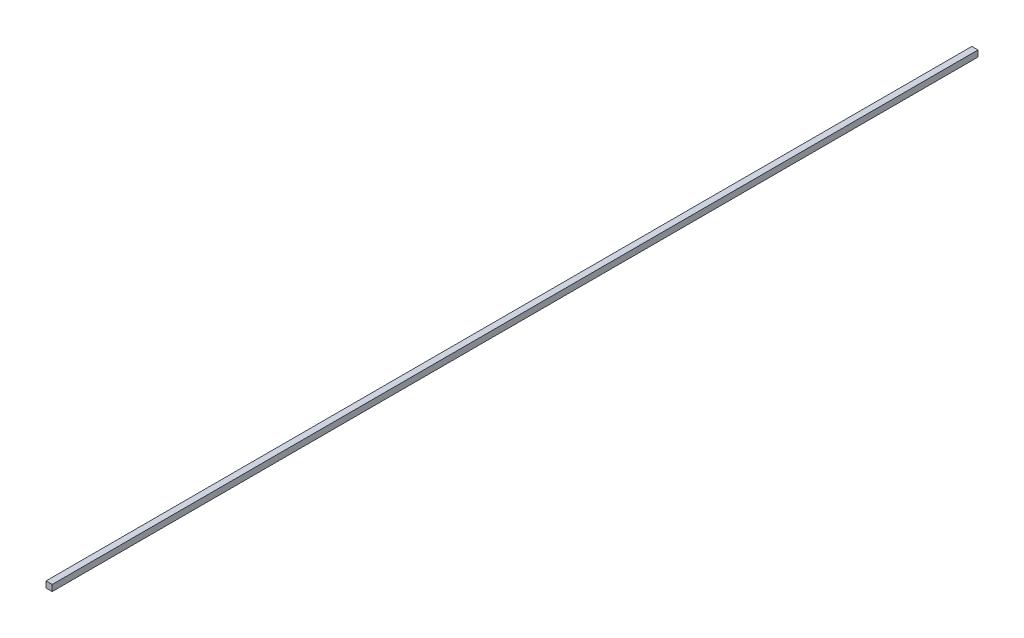
ISO-10303-21;
HEADER;
FILE_DESCRIPTION(('STEP AP214'),'2;1');
FILE_NAME('part.step','',(''),(''),'','','');
FILE_SCHEMA(('AUTOMOTIVE_DESIGN { 1 0 10303 214 1 1 1 1 }'));
ENDSEC;
DATA;
#1=APPLICATION_CONTEXT('core data for automotive mechanical design processes');
#2=APPLICATION_PROTOCOL_DEFINITION('international standard','automotive_design',2000,#1);
#3=PRODUCT_CONTEXT('',#1,'mechanical');
#4=PRODUCT('Part','Part','',(#3));
#5=PRODUCT_RELATED_PRODUCT_CATEGORY('part','',(#4));
#6=PRODUCT_DEFINITION_FORMATION('','',#4);
#7=PRODUCT_DEFINITION_CONTEXT('part definition',#1,'design');
#8=PRODUCT_DEFINITION('design','',#6,#7);
#9=PRODUCT_DEFINITION_SHAPE('','',#8);
#10=(LENGTH_UNIT() NAMED_UNIT(*) SI_UNIT(.MILLI.,.METRE.));
#11=(NAMED_UNIT(*) PLANE_ANGLE_UNIT() SI_UNIT($,.RADIAN.));
#12=(NAMED_UNIT(*) SI_UNIT($,.STERADIAN.) SOLID_ANGLE_UNIT());
#13=UNCERTAINTY_MEASURE_WITH_UNIT(LENGTH_MEASURE(1.E-05),#10,'distance_accuracy_value','');
#14=(GEOMETRIC_REPRESENTATION_CONTEXT(3) GLOBAL_UNCERTAINTY_ASSIGNED_CONTEXT((#13)) GLOBAL_UNIT_ASSIGNED_CONTEXT((#10,
#11,#12)) REPRESENTATION_CONTEXT('',''));
#15=CARTESIAN_POINT('',(0.,0.,0.));
#16=DIRECTION('',(0.,0.,1.));
#17=DIRECTION('',(1.,0.,0.));
#18=AXIS2_PLACEMENT_3D('',#15,#16,#17);
#19=CARTESIAN_POINT('',(2.,2.,600.));
#20=DIRECTION('',(-1.,0.,0.));
#21=DIRECTION('',(0.,-1.,0.));
#22=AXIS2_PLACEMENT_3D('',#19,#20,#21);
#23=PLANE('',#22);
#24=DIRECTION('',(0.,1.,0.));
#25=VECTOR('',#24,1.);
#26=CARTESIAN_POINT('',(2.,2.,0.));
#27=LINE('',#26,#25);
#28=CARTESIAN_POINT('',(2.,-2.,0.));
#29=VERTEX_POINT('',#28);
#30=CARTESIAN_POINT('',(2.,2.,0.));
#31=VERTEX_POINT('',#30);
#32=EDGE_CURVE('E107',#29,#31,#27,.T.);
#33=ORIENTED_EDGE('',*,*,#32,.T.);
#34=DIRECTION('',(0.,0.,-1.));
#35=VECTOR('',#34,1.);
#36=CARTESIAN_POINT('',(2.,2.,600.));
#37=LINE('',#36,#35);
#38=CARTESIAN_POINT('',(2.,2.,600.));
#39=VERTEX_POINT('',#38);
#40=EDGE_CURVE('E11',#39,#31,#37,.T.);
#41=ORIENTED_EDGE('',*,*,#40,.F.);
#42=DIRECTION('',(0.,1.,0.));
#43=VECTOR('',#42,1.);
#44=CARTESIAN_POINT('',(2.,2.,600.));
#45=LINE('',#44,#43);
#46=CARTESIAN_POINT('',(2.,-2.,600.));
#47=VERTEX_POINT('',#46);
#48=EDGE_CURVE('E91',#47,#39,#45,.T.);
#49=ORIENTED_EDGE('',*,*,#48,.F.);
#50=DIRECTION('',(0.,0.,-1.));
#51=VECTOR('',#50,1.);
#52=CARTESIAN_POINT('',(2.,-2.,600.));
#53=LINE('',#52,#51);
#54=EDGE_CURVE('E103',#47,#29,#53,.T.);
#55=ORIENTED_EDGE('',*,*,#54,.T.);
#56=EDGE_LOOP('',(#33,#41,#49,#55));
#57=FACE_BOUND('',#56,.T.);
#58=ADVANCED_FACE('F39',(#57),#23,.F.);
#59=CARTESIAN_POINT('',(-2.,2.,600.));
#60=DIRECTION('',(0.,-1.,0.));
#61=DIRECTION('',(0.,0.,-1.));
#62=AXIS2_PLACEMENT_3D('',#59,#60,#61);
#63=PLANE('',#62);
#64=DIRECTION('',(-1.,0.,0.));
#65=VECTOR('',#64,1.);
#66=CARTESIAN_POINT('',(-2.,2.,0.));
#67=LINE('',#66,#65);
#68=CARTESIAN_POINT('',(-2.,2.,0.));
#69=VERTEX_POINT('',#68);
#70=EDGE_CURVE('E96',#31,#69,#67,.T.);
#71=ORIENTED_EDGE('',*,*,#70,.T.);
#72=DIRECTION('',(0.,0.,-1.));
#73=VECTOR('',#72,1.);
#74=CARTESIAN_POINT('',(-2.,2.,600.));
#75=LINE('',#74,#73);
#76=CARTESIAN_POINT('',(-2.,2.,600.));
#77=VERTEX_POINT('',#76);
#78=EDGE_CURVE('E48',#77,#69,#75,.T.);
#79=ORIENTED_EDGE('',*,*,#78,.F.);
#80=DIRECTION('',(-1.,0.,0.));
#81=VECTOR('',#80,1.);
#82=CARTESIAN_POINT('',(-2.,2.,600.));
#83=LINE('',#82,#81);
#84=EDGE_CURVE('E86',#39,#77,#83,.T.);
#85=ORIENTED_EDGE('',*,*,#84,.F.);
#86=ORIENTED_EDGE('',*,*,#40,.T.);
#87=EDGE_LOOP('',(#71,#79,#85,#86));
#88=FACE_BOUND('',#87,.T.);
#89=ADVANCED_FACE('F95',(#88),#63,.F.);
#90=CARTESIAN_POINT('',(-2.,2.,600.));
#91=DIRECTION('',(1.,0.,0.));
#92=DIRECTION('',(0.,1.,0.));
#93=AXIS2_PLACEMENT_3D('',#90,#91,#92);
#94=PLANE('',#93);
#95=DIRECTION('',(0.,-1.,0.));
#96=VECTOR('',#95,1.);
#97=CARTESIAN_POINT('',(-2.,2.,0.));
#98=LINE('',#97,#96);
#99=CARTESIAN_POINT('',(-2.,-2.,0.));
#100=VERTEX_POINT('',#99);
#101=EDGE_CURVE('E73',#69,#100,#98,.T.);
#102=ORIENTED_EDGE('',*,*,#101,.T.);
#103=DIRECTION('',(0.,0.,-1.));
#104=VECTOR('',#103,1.);
#105=CARTESIAN_POINT('',(-2.,-2.,600.));
#106=LINE('',#105,#104);
#107=CARTESIAN_POINT('',(-2.,-2.,600.));
#108=VERTEX_POINT('',#107);
#109=EDGE_CURVE('E98',#108,#100,#106,.T.);
#110=ORIENTED_EDGE('',*,*,#109,.F.);
#111=DIRECTION('',(0.,-1.,0.));
#112=VECTOR('',#111,1.);
#113=CARTESIAN_POINT('',(-2.,2.,600.));
#114=LINE('',#113,#112);
#115=EDGE_CURVE('E89',#77,#108,#114,.T.);
#116=ORIENTED_EDGE('',*,*,#115,.F.);
#117=ORIENTED_EDGE('',*,*,#78,.T.);
#118=EDGE_LOOP('',(#102,#110,#116,#117));
#119=FACE_BOUND('',#118,.T.);
#120=ADVANCED_FACE('F99',(#119),#94,.F.);
#121=CARTESIAN_POINT('',(-2.,-2.,600.));
#122=DIRECTION('',(0.,1.,0.));
#123=DIRECTION('',(0.,0.,1.));
#124=AXIS2_PLACEMENT_3D('',#121,#122,#123);
#125=PLANE('',#124);
#126=DIRECTION('',(1.,0.,0.));
#127=VECTOR('',#126,1.);
#128=CARTESIAN_POINT('',(-2.,-2.,0.));
#129=LINE('',#128,#127);
#130=EDGE_CURVE('E79',#100,#29,#129,.T.);
#131=ORIENTED_EDGE('',*,*,#130,.T.);
#132=ORIENTED_EDGE('',*,*,#54,.F.);
#133=DIRECTION('',(1.,0.,0.));
#134=VECTOR('',#133,1.);
#135=CARTESIAN_POINT('',(-2.,-2.,600.));
#136=LINE('',#135,#134);
#137=EDGE_CURVE('E56',#108,#47,#136,.T.);
#138=ORIENTED_EDGE('',*,*,#137,.F.);
#139=ORIENTED_EDGE('',*,*,#109,.T.);
#140=EDGE_LOOP('',(#131,#132,#138,#139));
#141=FACE_BOUND('',#140,.T.);
#142=ADVANCED_FACE('F120',(#141),#125,.F.);
#143=CARTESIAN_POINT('',(0.,0.,600.));
#144=DIRECTION('',(0.,0.,1.));
#145=DIRECTION('',(1.,0.,0.));
#146=AXIS2_PLACEMENT_3D('',#143,#144,#145);
#147=PLANE('',#146);
#148=ORIENTED_EDGE('',*,*,#48,.T.);
#149=ORIENTED_EDGE('',*,*,#84,.T.);
#150=ORIENTED_EDGE('',*,*,#115,.T.);
#151=ORIENTED_EDGE('',*,*,#137,.T.);
#152=EDGE_LOOP('',(#148,#149,#150,#151));
#153=FACE_BOUND('',#152,.T.);
#154=ADVANCED_FACE('F87',(#153),#147,.T.);
#155=CARTESIAN_POINT('',(0.,0.,0.));
#156=DIRECTION('',(0.,0.,1.));
#157=DIRECTION('',(1.,0.,0.));
#158=AXIS2_PLACEMENT_3D('',#155,#156,#157);
#159=PLANE('',#158);
#160=ORIENTED_EDGE('',*,*,#32,.F.);
#161=ORIENTED_EDGE('',*,*,#130,.F.);
#162=ORIENTED_EDGE('',*,*,#101,.F.);
#163=ORIENTED_EDGE('',*,*,#70,.F.);
#164=EDGE_LOOP('',(#160,#161,#162,#163));
#165=FACE_BOUND('',#164,.T.);
#166=ADVANCED_FACE('F123',(#165),#159,.F.);
#167=CLOSED_SHELL('',(#58,#89,#120,#142,#154,#166));
#168=MANIFOLD_SOLID_BREP('B2',#167);
#169=ADVANCED_BREP_SHAPE_REPRESENTATION('',(#18,#168),#14);
#170=SHAPE_DEFINITION_REPRESENTATION(#9,#169);
ENDSEC;
END-ISO-10303-21;
